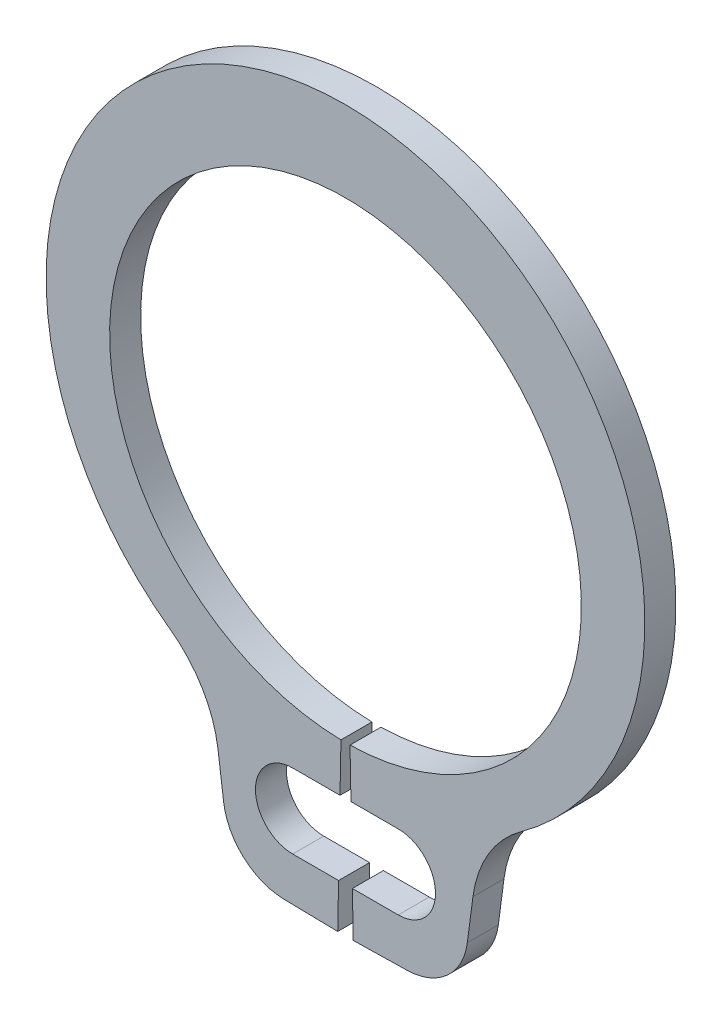
ISO-10303-21;
HEADER;
FILE_DESCRIPTION(('STEP AP214'),'2;1');
FILE_NAME('part.step','',(''),(''),'','','');
FILE_SCHEMA(('AUTOMOTIVE_DESIGN { 1 0 10303 214 1 1 1 1 }'));
ENDSEC;
DATA;
#1=APPLICATION_CONTEXT('core data for automotive mechanical design processes');
#2=APPLICATION_PROTOCOL_DEFINITION('international standard','automotive_design',2000,#1);
#3=PRODUCT_CONTEXT('',#1,'mechanical');
#4=PRODUCT('Part','Part','',(#3));
#5=PRODUCT_RELATED_PRODUCT_CATEGORY('part','',(#4));
#6=PRODUCT_DEFINITION_FORMATION('','',#4);
#7=PRODUCT_DEFINITION_CONTEXT('part definition',#1,'design');
#8=PRODUCT_DEFINITION('design','',#6,#7);
#9=PRODUCT_DEFINITION_SHAPE('','',#8);
#10=(LENGTH_UNIT() NAMED_UNIT(*) SI_UNIT(.MILLI.,.METRE.));
#11=(NAMED_UNIT(*) PLANE_ANGLE_UNIT() SI_UNIT($,.RADIAN.));
#12=(NAMED_UNIT(*) SI_UNIT($,.STERADIAN.) SOLID_ANGLE_UNIT());
#13=UNCERTAINTY_MEASURE_WITH_UNIT(LENGTH_MEASURE(1.E-05),#10,'distance_accuracy_value','');
#14=(GEOMETRIC_REPRESENTATION_CONTEXT(3) GLOBAL_UNCERTAINTY_ASSIGNED_CONTEXT((#13)) GLOBAL_UNIT_ASSIGNED_CONTEXT((#10,
#11,#12)) REPRESENTATION_CONTEXT('',''));
#15=CARTESIAN_POINT('',(0.,0.,0.));
#16=DIRECTION('',(0.,0.,1.));
#17=DIRECTION('',(1.,0.,0.));
#18=AXIS2_PLACEMENT_3D('',#15,#16,#17);
#19=CARTESIAN_POINT('',(-51.5537344991612,-0.604973268345121,26.0553388755765));
#20=DIRECTION('',(0.999815071658151,-0.0192307692307693,0.));
#21=DIRECTION('',(0.0192307692307693,0.999815071658151,0.));
#22=AXIS2_PLACEMENT_3D('',#19,#20,#21);
#23=PLANE('',#22);
#24=DIRECTION('',(0.,0.,1.));
#25=VECTOR('',#24,1.);
#26=CARTESIAN_POINT('',(-51.5612496991894,-0.99569140159236,26.0553388755765));
#27=LINE('',#26,#25);
#28=CARTESIAN_POINT('',(-51.5612496991894,-0.99569140159236,26.0553388755765));
#29=VERTEX_POINT('',#28);
#30=CARTESIAN_POINT('',(-51.5612496991894,-0.99569140159236,26.3053388755765));
#31=VERTEX_POINT('',#30);
#32=EDGE_CURVE('E222',#29,#31,#27,.T.);
#33=ORIENTED_EDGE('',*,*,#32,.F.);
#34=DIRECTION('',(0.0192307692307693,0.999815071658151,0.));
#35=VECTOR('',#34,1.);
#36=CARTESIAN_POINT('',(-51.5537344991612,-0.604973268345121,26.0553388755765));
#37=LINE('',#36,#35);
#38=CARTESIAN_POINT('',(-51.5537344991612,-0.604973268345121,26.0553388755765));
#39=VERTEX_POINT('',#38);
#40=EDGE_CURVE('E207',#29,#39,#37,.T.);
#41=ORIENTED_EDGE('',*,*,#40,.T.);
#42=DIRECTION('',(0.,0.,1.));
#43=VECTOR('',#42,1.);
#44=CARTESIAN_POINT('',(-51.5537344991612,-0.604973268345121,26.0553388755765));
#45=LINE('',#44,#43);
#46=CARTESIAN_POINT('',(-51.5537344991612,-0.604973268345121,26.3053388755765));
#47=VERTEX_POINT('',#46);
#48=EDGE_CURVE('E11',#39,#47,#45,.T.);
#49=ORIENTED_EDGE('',*,*,#48,.T.);
#50=DIRECTION('',(0.0192307692307693,0.999815071658151,0.));
#51=VECTOR('',#50,1.);
#52=CARTESIAN_POINT('',(-51.5537344991612,-0.604973268345121,26.3053388755765));
#53=LINE('',#52,#51);
#54=EDGE_CURVE('E324',#31,#47,#53,.T.);
#55=ORIENTED_EDGE('',*,*,#54,.F.);
#56=EDGE_LOOP('',(#33,#41,#49,#55));
#57=FACE_BOUND('',#56,.T.);
#58=ADVANCED_FACE('F45',(#57),#23,.T.);
#59=CARTESIAN_POINT('',(-51.4806575760843,-0.604973268345121,26.0553388755765));
#60=DIRECTION('',(-0.999815071658151,-0.019230769230769,0.));
#61=DIRECTION('',(0.019230769230769,-0.999815071658151,0.));
#62=AXIS2_PLACEMENT_3D('',#59,#60,#61);
#63=PLANE('',#62);
#64=DIRECTION('',(0.,0.,-1.));
#65=VECTOR('',#64,1.);
#66=CARTESIAN_POINT('',(-51.473142376056,-0.99569140159236,26.0553388755765));
#67=LINE('',#66,#65);
#68=CARTESIAN_POINT('',(-51.473142376056,-0.99569140159236,26.3053388755765));
#69=VERTEX_POINT('',#68);
#70=CARTESIAN_POINT('',(-51.473142376056,-0.99569140159236,26.0553388755765));
#71=VERTEX_POINT('',#70);
#72=EDGE_CURVE('E369',#69,#71,#67,.T.);
#73=ORIENTED_EDGE('',*,*,#72,.F.);
#74=DIRECTION('',(0.019230769230769,-0.999815071658151,0.));
#75=VECTOR('',#74,1.);
#76=CARTESIAN_POINT('',(-51.4806575760843,-0.604973268345121,26.3053388755765));
#77=LINE('',#76,#75);
#78=CARTESIAN_POINT('',(-51.4806575760843,-0.604973268345121,26.3053388755765));
#79=VERTEX_POINT('',#78);
#80=EDGE_CURVE('E284',#79,#69,#77,.T.);
#81=ORIENTED_EDGE('',*,*,#80,.F.);
#82=DIRECTION('',(0.,0.,1.));
#83=VECTOR('',#82,1.);
#84=CARTESIAN_POINT('',(-51.4806575760843,-0.604973268345121,26.0553388755765));
#85=LINE('',#84,#83);
#86=CARTESIAN_POINT('',(-51.4806575760843,-0.604973268345121,26.0553388755765));
#87=VERTEX_POINT('',#86);
#88=EDGE_CURVE('E49',#87,#79,#85,.T.);
#89=ORIENTED_EDGE('',*,*,#88,.F.);
#90=DIRECTION('',(0.019230769230769,-0.999815071658151,0.));
#91=VECTOR('',#90,1.);
#92=CARTESIAN_POINT('',(-51.4806575760843,-0.604973268345121,26.0553388755765));
#93=LINE('',#92,#91);
#94=EDGE_CURVE('E236',#87,#71,#93,.T.);
#95=ORIENTED_EDGE('',*,*,#94,.T.);
#96=EDGE_LOOP('',(#73,#81,#89,#95));
#97=FACE_BOUND('',#96,.T.);
#98=ADVANCED_FACE('F368',(#97),#63,.T.);
#99=CARTESIAN_POINT('',(-51.5171960376227,1.29467536780536,26.0553388755765));
#100=DIRECTION('',(0.,0.,1.));
#101=DIRECTION('',(1.,0.,0.));
#102=AXIS2_PLACEMENT_3D('',#99,#100,#101);
#103=CYLINDRICAL_SURFACE('',#102,1.9);
#104=CARTESIAN_POINT('',(-51.5171960376227,1.29467536780536,26.3053388755765));
#105=DIRECTION('',(0.,0.,-1.));
#106=DIRECTION('',(1.,0.,0.));
#107=AXIS2_PLACEMENT_3D('',#104,#105,#106);
#108=CIRCLE('',#107,1.9);
#109=EDGE_CURVE('E228',#47,#79,#108,.T.);
#110=ORIENTED_EDGE('',*,*,#109,.F.);
#111=ORIENTED_EDGE('',*,*,#48,.F.);
#112=CARTESIAN_POINT('',(-51.5171960376227,1.29467536780536,26.0553388755765));
#113=DIRECTION('',(0.,0.,-1.));
#114=DIRECTION('',(1.,0.,0.));
#115=AXIS2_PLACEMENT_3D('',#112,#113,#114);
#116=CIRCLE('',#115,1.9);
#117=EDGE_CURVE('E230',#39,#87,#116,.T.);
#118=ORIENTED_EDGE('',*,*,#117,.T.);
#119=ORIENTED_EDGE('',*,*,#88,.T.);
#120=EDGE_LOOP('',(#110,#111,#118,#119));
#121=FACE_BOUND('',#120,.T.);
#122=ADVANCED_FACE('F47',(#121),#103,.F.);
#123=DIRECTION('',(0.,0.,-1.));
#124=VECTOR('',#123,1.);
#125=CARTESIAN_POINT('',(-51.5727902949111,-1.59569140159236,26.0553388755765));
#126=LINE('',#125,#124);
#127=CARTESIAN_POINT('',(-51.5727902949111,-1.59569140159236,26.3053388755765));
#128=VERTEX_POINT('',#127);
#129=CARTESIAN_POINT('',(-51.5727902949111,-1.59569140159236,26.0553388755765));
#130=VERTEX_POINT('',#129);
#131=EDGE_CURVE('E400',#128,#130,#126,.T.);
#132=ORIENTED_EDGE('',*,*,#131,.F.);
#133=CARTESIAN_POINT('',(-51.5796960376227,-1.95472361508362,26.3053388755765));
#134=VERTEX_POINT('',#133);
#135=EDGE_CURVE('E235',#134,#128,#53,.T.);
#136=ORIENTED_EDGE('',*,*,#135,.F.);
#137=DIRECTION('',(0.,0.,1.));
#138=VECTOR('',#137,1.);
#139=CARTESIAN_POINT('',(-51.5796960376227,-1.95472361508362,26.0553388755765));
#140=LINE('',#139,#138);
#141=CARTESIAN_POINT('',(-51.5796960376227,-1.95472361508362,26.0553388755765));
#142=VERTEX_POINT('',#141);
#143=EDGE_CURVE('E55',#142,#134,#140,.T.);
#144=ORIENTED_EDGE('',*,*,#143,.F.);
#145=EDGE_CURVE('E276',#142,#130,#37,.T.);
#146=ORIENTED_EDGE('',*,*,#145,.T.);
#147=EDGE_LOOP('',(#132,#136,#144,#146));
#148=FACE_BOUND('',#147,.T.);
#149=ADVANCED_FACE('F429',(#148),#23,.T.);
#150=CARTESIAN_POINT('',(-51.5796960376227,-1.95472361508362,26.0553388755765));
#151=DIRECTION('',(-0.0192307692307683,-0.999815071658151,0.));
#152=DIRECTION('',(0.999815071658151,-0.0192307692307683,0.));
#153=AXIS2_PLACEMENT_3D('',#150,#151,#152);
#154=PLANE('',#153);
#155=DIRECTION('',(0.999815071658151,-0.0192307692307683,0.));
#156=VECTOR('',#155,1.);
#157=CARTESIAN_POINT('',(-51.5796960376227,-1.95472361508362,26.3053388755765));
#158=LINE('',#157,#156);
#159=CARTESIAN_POINT('',(-52.0124323239493,-1.94640022419262,26.3053388755765));
#160=VERTEX_POINT('',#159);
#161=EDGE_CURVE('E320',#160,#134,#158,.T.);
#162=ORIENTED_EDGE('',*,*,#161,.F.);
#163=DIRECTION('',(0.,0.,1.));
#164=VECTOR('',#163,1.);
#165=CARTESIAN_POINT('',(-52.0124323239493,-1.94640022419262,26.0553388755765));
#166=LINE('',#165,#164);
#167=CARTESIAN_POINT('',(-52.0124323239493,-1.94640022419262,26.0553388755765));
#168=VERTEX_POINT('',#167);
#169=EDGE_CURVE('E330',#168,#160,#166,.T.);
#170=ORIENTED_EDGE('',*,*,#169,.F.);
#171=DIRECTION('',(0.999815071658151,-0.0192307692307683,0.));
#172=VECTOR('',#171,1.);
#173=CARTESIAN_POINT('',(-51.5796960376227,-1.95472361508362,26.0553388755765));
#174=LINE('',#173,#172);
#175=EDGE_CURVE('E272',#168,#142,#174,.T.);
#176=ORIENTED_EDGE('',*,*,#175,.T.);
#177=ORIENTED_EDGE('',*,*,#143,.T.);
#178=EDGE_LOOP('',(#162,#170,#176,#177));
#179=FACE_BOUND('',#178,.T.);
#180=ADVANCED_FACE('F435',(#179),#154,.T.);
#181=CARTESIAN_POINT('',(-52.0028169393339,-1.44649268836355,26.0553388755765));
#182=DIRECTION('',(0.,0.,1.));
#183=DIRECTION('',(1.,0.,0.));
#184=AXIS2_PLACEMENT_3D('',#181,#182,#183);
#185=CYLINDRICAL_SURFACE('',#184,0.5);
#186=CARTESIAN_POINT('',(-52.0028169393339,-1.44649268836355,26.3053388755765));
#187=DIRECTION('',(0.,0.,1.));
#188=DIRECTION('',(1.,0.,0.));
#189=AXIS2_PLACEMENT_3D('',#186,#187,#188);
#190=CIRCLE('',#189,0.5);
#191=CARTESIAN_POINT('',(-52.4985393700208,-1.51175578447357,26.3053388755765));
#192=VERTEX_POINT('',#191);
#193=EDGE_CURVE('E316',#192,#160,#190,.T.);
#194=ORIENTED_EDGE('',*,*,#193,.F.);
#195=DIRECTION('',(0.,0.,1.));
#196=VECTOR('',#195,1.);
#197=CARTESIAN_POINT('',(-52.4985393700208,-1.51175578447357,26.0553388755765));
#198=LINE('',#197,#196);
#199=CARTESIAN_POINT('',(-52.4985393700208,-1.51175578447357,26.0553388755765));
#200=VERTEX_POINT('',#199);
#201=EDGE_CURVE('E333',#200,#192,#198,.T.);
#202=ORIENTED_EDGE('',*,*,#201,.F.);
#203=CARTESIAN_POINT('',(-52.0028169393339,-1.44649268836355,26.0553388755765));
#204=DIRECTION('',(0.,0.,1.));
#205=DIRECTION('',(1.,0.,0.));
#206=AXIS2_PLACEMENT_3D('',#203,#204,#205);
#207=CIRCLE('',#206,0.5);
#208=EDGE_CURVE('E268',#200,#168,#207,.T.);
#209=ORIENTED_EDGE('',*,*,#208,.T.);
#210=ORIENTED_EDGE('',*,*,#169,.T.);
#211=EDGE_LOOP('',(#194,#202,#209,#210));
#212=FACE_BOUND('',#211,.T.);
#213=ADVANCED_FACE('F441',(#212),#185,.T.);
#214=CARTESIAN_POINT('',(-52.5438349039949,-1.16770204600146,26.0553388755765));
#215=DIRECTION('',(-0.99144486137381,-0.130526192220052,0.));
#216=DIRECTION('',(0.130526192220052,-0.99144486137381,0.));
#217=AXIS2_PLACEMENT_3D('',#214,#215,#216);
#218=PLANE('',#217);
#219=DIRECTION('',(0.130526192220052,-0.99144486137381,0.));
#220=VECTOR('',#219,1.);
#221=CARTESIAN_POINT('',(-52.5438349039949,-1.16770204600146,26.3053388755765));
#222=LINE('',#221,#220);
#223=CARTESIAN_POINT('',(-52.5438349039949,-1.16770204600146,26.3053388755765));
#224=VERTEX_POINT('',#223);
#225=EDGE_CURVE('E312',#224,#192,#222,.T.);
#226=ORIENTED_EDGE('',*,*,#225,.F.);
#227=DIRECTION('',(0.,0.,1.));
#228=VECTOR('',#227,1.);
#229=CARTESIAN_POINT('',(-52.5438349039949,-1.16770204600146,26.0553388755765));
#230=LINE('',#229,#228);
#231=CARTESIAN_POINT('',(-52.5438349039949,-1.16770204600146,26.0553388755765));
#232=VERTEX_POINT('',#231);
#233=EDGE_CURVE('E336',#232,#224,#230,.T.);
#234=ORIENTED_EDGE('',*,*,#233,.F.);
#235=DIRECTION('',(0.130526192220052,-0.99144486137381,0.));
#236=VECTOR('',#235,1.);
#237=CARTESIAN_POINT('',(-52.5438349039949,-1.16770204600146,26.0553388755765));
#238=LINE('',#237,#236);
#239=EDGE_CURVE('E264',#232,#200,#238,.T.);
#240=ORIENTED_EDGE('',*,*,#239,.T.);
#241=ORIENTED_EDGE('',*,*,#201,.T.);
#242=EDGE_LOOP('',(#226,#234,#240,#241));
#243=FACE_BOUND('',#242,.T.);
#244=ADVANCED_FACE('F580',(#243),#218,.T.);
#245=CARTESIAN_POINT('',(-53.4852993061026,-1.29164818592856,26.0553388755765));
#246=DIRECTION('',(0.,0.,1.));
#247=DIRECTION('',(1.,0.,0.));
#248=AXIS2_PLACEMENT_3D('',#245,#246,#247);
#249=CYLINDRICAL_SURFACE('',#248,0.949588261321083);
#250=CARTESIAN_POINT('',(-53.4852993061026,-1.29164818592856,26.3053388755765));
#251=DIRECTION('',(0.,0.,-1.));
#252=DIRECTION('',(1.,0.,0.));
#253=AXIS2_PLACEMENT_3D('',#250,#251,#252);
#254=CIRCLE('',#253,0.949588261321083);
#255=CARTESIAN_POINT('',(-52.9292788355123,-0.521869579884333,26.3053388755765));
#256=VERTEX_POINT('',#255);
#257=EDGE_CURVE('E308',#256,#224,#254,.T.);
#258=ORIENTED_EDGE('',*,*,#257,.F.);
#259=DIRECTION('',(0.,0.,1.));
#260=VECTOR('',#259,1.);
#261=CARTESIAN_POINT('',(-52.9292788355123,-0.521869579884333,26.0553388755765));
#262=LINE('',#261,#260);
#263=CARTESIAN_POINT('',(-52.9292788355123,-0.521869579884333,26.0553388755765));
#264=VERTEX_POINT('',#263);
#265=EDGE_CURVE('E339',#264,#256,#262,.T.);
#266=ORIENTED_EDGE('',*,*,#265,.F.);
#267=CARTESIAN_POINT('',(-53.4852993061026,-1.29164818592856,26.0553388755765));
#268=DIRECTION('',(0.,0.,-1.));
#269=DIRECTION('',(1.,0.,0.));
#270=AXIS2_PLACEMENT_3D('',#267,#268,#269);
#271=CIRCLE('',#270,0.949588261321083);
#272=EDGE_CURVE('E260',#264,#232,#271,.T.);
#273=ORIENTED_EDGE('',*,*,#272,.T.);
#274=ORIENTED_EDGE('',*,*,#233,.T.);
#275=EDGE_LOOP('',(#258,#266,#273,#274));
#276=FACE_BOUND('',#275,.T.);
#277=ADVANCED_FACE('F570',(#276),#249,.F.);
#278=CARTESIAN_POINT('',(-51.5171960376227,1.43307845759456,26.0553388755765));
#279=DIRECTION('',(0.,0.,1.));
#280=DIRECTION('',(1.,0.,0.));
#281=AXIS2_PLACEMENT_3D('',#278,#279,#280);
#282=CYLINDRICAL_SURFACE('',#281,2.41159691021081);
#283=CARTESIAN_POINT('',(-51.5171960376227,1.43307845759456,26.3053388755765));
#284=DIRECTION('',(0.,0.,1.));
#285=DIRECTION('',(1.,0.,0.));
#286=AXIS2_PLACEMENT_3D('',#283,#284,#285);
#287=CIRCLE('',#286,2.41159691021081);
#288=CARTESIAN_POINT('',(-50.1051132397331,-0.521869579884334,26.3053388755765));
#289=VERTEX_POINT('',#288);
#290=EDGE_CURVE('E304',#289,#256,#287,.T.);
#291=ORIENTED_EDGE('',*,*,#290,.F.);
#292=DIRECTION('',(0.,0.,1.));
#293=VECTOR('',#292,1.);
#294=CARTESIAN_POINT('',(-50.1051132397331,-0.521869579884334,26.0553388755765));
#295=LINE('',#294,#293);
#296=CARTESIAN_POINT('',(-50.1051132397331,-0.521869579884334,26.0553388755765));
#297=VERTEX_POINT('',#296);
#298=EDGE_CURVE('E342',#297,#289,#295,.T.);
#299=ORIENTED_EDGE('',*,*,#298,.F.);
#300=CARTESIAN_POINT('',(-51.5171960376227,1.43307845759456,26.0553388755765));
#301=DIRECTION('',(0.,0.,1.));
#302=DIRECTION('',(1.,0.,0.));
#303=AXIS2_PLACEMENT_3D('',#300,#301,#302);
#304=CIRCLE('',#303,2.41159691021081);
#305=EDGE_CURVE('E256',#297,#264,#304,.T.);
#306=ORIENTED_EDGE('',*,*,#305,.T.);
#307=ORIENTED_EDGE('',*,*,#265,.T.);
#308=EDGE_LOOP('',(#291,#299,#306,#307));
#309=FACE_BOUND('',#308,.T.);
#310=ADVANCED_FACE('F560',(#309),#282,.T.);
#311=CARTESIAN_POINT('',(-49.5490927691429,-1.29164818592856,26.0553388755765));
#312=DIRECTION('',(0.,0.,1.));
#313=DIRECTION('',(1.,0.,0.));
#314=AXIS2_PLACEMENT_3D('',#311,#312,#313);
#315=CYLINDRICAL_SURFACE('',#314,0.949588261321083);
#316=CARTESIAN_POINT('',(-49.5490927691429,-1.29164818592856,26.3053388755765));
#317=DIRECTION('',(0.,0.,-1.));
#318=DIRECTION('',(1.,0.,0.));
#319=AXIS2_PLACEMENT_3D('',#316,#317,#318);
#320=CIRCLE('',#319,0.949588261321083);
#321=CARTESIAN_POINT('',(-50.4905571712505,-1.16770204600146,26.3053388755765));
#322=VERTEX_POINT('',#321);
#323=EDGE_CURVE('E300',#322,#289,#320,.T.);
#324=ORIENTED_EDGE('',*,*,#323,.F.);
#325=DIRECTION('',(0.,0.,1.));
#326=VECTOR('',#325,1.);
#327=CARTESIAN_POINT('',(-50.4905571712505,-1.16770204600146,26.0553388755765));
#328=LINE('',#327,#326);
#329=CARTESIAN_POINT('',(-50.4905571712505,-1.16770204600146,26.0553388755765));
#330=VERTEX_POINT('',#329);
#331=EDGE_CURVE('E345',#330,#322,#328,.T.);
#332=ORIENTED_EDGE('',*,*,#331,.F.);
#333=CARTESIAN_POINT('',(-49.5490927691429,-1.29164818592856,26.0553388755765));
#334=DIRECTION('',(0.,0.,-1.));
#335=DIRECTION('',(1.,0.,0.));
#336=AXIS2_PLACEMENT_3D('',#333,#334,#335);
#337=CIRCLE('',#336,0.949588261321083);
#338=EDGE_CURVE('E252',#330,#297,#337,.T.);
#339=ORIENTED_EDGE('',*,*,#338,.T.);
#340=ORIENTED_EDGE('',*,*,#298,.T.);
#341=EDGE_LOOP('',(#324,#332,#339,#340));
#342=FACE_BOUND('',#341,.T.);
#343=ADVANCED_FACE('F550',(#342),#315,.F.);
#344=CARTESIAN_POINT('',(-50.4905571712505,-1.16770204600146,26.0553388755765));
#345=DIRECTION('',(0.99144486137381,-0.130526192220054,0.));
#346=DIRECTION('',(0.130526192220054,0.99144486137381,0.));
#347=AXIS2_PLACEMENT_3D('',#344,#345,#346);
#348=PLANE('',#347);
#349=DIRECTION('',(0.130526192220054,0.99144486137381,0.));
#350=VECTOR('',#349,1.);
#351=CARTESIAN_POINT('',(-50.4905571712505,-1.16770204600146,26.3053388755765));
#352=LINE('',#351,#350);
#353=CARTESIAN_POINT('',(-50.5358527052247,-1.51175578447357,26.3053388755765));
#354=VERTEX_POINT('',#353);
#355=EDGE_CURVE('E296',#354,#322,#352,.T.);
#356=ORIENTED_EDGE('',*,*,#355,.F.);
#357=DIRECTION('',(0.,0.,1.));
#358=VECTOR('',#357,1.);
#359=CARTESIAN_POINT('',(-50.5358527052247,-1.51175578447357,26.0553388755765));
#360=LINE('',#359,#358);
#361=CARTESIAN_POINT('',(-50.5358527052247,-1.51175578447357,26.0553388755765));
#362=VERTEX_POINT('',#361);
#363=EDGE_CURVE('E348',#362,#354,#360,.T.);
#364=ORIENTED_EDGE('',*,*,#363,.F.);
#365=DIRECTION('',(0.130526192220054,0.99144486137381,0.));
#366=VECTOR('',#365,1.);
#367=CARTESIAN_POINT('',(-50.4905571712505,-1.16770204600146,26.0553388755765));
#368=LINE('',#367,#366);
#369=EDGE_CURVE('E248',#362,#330,#368,.T.);
#370=ORIENTED_EDGE('',*,*,#369,.T.);
#371=ORIENTED_EDGE('',*,*,#331,.T.);
#372=EDGE_LOOP('',(#356,#364,#370,#371));
#373=FACE_BOUND('',#372,.T.);
#374=ADVANCED_FACE('F540',(#373),#348,.T.);
#375=CARTESIAN_POINT('',(-51.0315751359116,-1.44649268836355,26.0553388755765));
#376=DIRECTION('',(0.,0.,1.));
#377=DIRECTION('',(1.,0.,0.));
#378=AXIS2_PLACEMENT_3D('',#375,#376,#377);
#379=CYLINDRICAL_SURFACE('',#378,0.5);
#380=CARTESIAN_POINT('',(-51.0315751359116,-1.44649268836355,26.3053388755765));
#381=DIRECTION('',(0.,0.,1.));
#382=DIRECTION('',(-1.,0.,0.));
#383=AXIS2_PLACEMENT_3D('',#380,#381,#382);
#384=CIRCLE('',#383,0.5);
#385=CARTESIAN_POINT('',(-51.0219597512962,-1.94640022419262,26.3053388755765));
#386=VERTEX_POINT('',#385);
#387=EDGE_CURVE('E292',#386,#354,#384,.T.);
#388=ORIENTED_EDGE('',*,*,#387,.F.);
#389=DIRECTION('',(0.,0.,1.));
#390=VECTOR('',#389,1.);
#391=CARTESIAN_POINT('',(-51.0219597512962,-1.94640022419262,26.0553388755765));
#392=LINE('',#391,#390);
#393=CARTESIAN_POINT('',(-51.0219597512962,-1.94640022419262,26.0553388755765));
#394=VERTEX_POINT('',#393);
#395=EDGE_CURVE('E351',#394,#386,#392,.T.);
#396=ORIENTED_EDGE('',*,*,#395,.F.);
#397=CARTESIAN_POINT('',(-51.0315751359116,-1.44649268836355,26.0553388755765));
#398=DIRECTION('',(0.,0.,1.));
#399=DIRECTION('',(-1.,0.,0.));
#400=AXIS2_PLACEMENT_3D('',#397,#398,#399);
#401=CIRCLE('',#400,0.5);
#402=EDGE_CURVE('E244',#394,#362,#401,.T.);
#403=ORIENTED_EDGE('',*,*,#402,.T.);
#404=ORIENTED_EDGE('',*,*,#363,.T.);
#405=EDGE_LOOP('',(#388,#396,#403,#404));
#406=FACE_BOUND('',#405,.T.);
#407=ADVANCED_FACE('F423',(#406),#379,.T.);
#408=CARTESIAN_POINT('',(-51.4546960376227,-1.95472361508362,26.0553388755765));
#409=DIRECTION('',(0.0192307692307683,-0.999815071658151,0.));
#410=DIRECTION('',(0.999815071658151,0.0192307692307683,0.));
#411=AXIS2_PLACEMENT_3D('',#408,#409,#410);
#412=PLANE('',#411);
#413=DIRECTION('',(0.999815071658151,0.0192307692307683,0.));
#414=VECTOR('',#413,1.);
#415=CARTESIAN_POINT('',(-51.4546960376227,-1.95472361508362,26.3053388755765));
#416=LINE('',#415,#414);
#417=CARTESIAN_POINT('',(-51.4546960376227,-1.95472361508362,26.3053388755765));
#418=VERTEX_POINT('',#417);
#419=EDGE_CURVE('E288',#418,#386,#416,.T.);
#420=ORIENTED_EDGE('',*,*,#419,.F.);
#421=DIRECTION('',(0.,0.,1.));
#422=VECTOR('',#421,1.);
#423=CARTESIAN_POINT('',(-51.4546960376227,-1.95472361508362,26.0553388755765));
#424=LINE('',#423,#422);
#425=CARTESIAN_POINT('',(-51.4546960376227,-1.95472361508362,26.0553388755765));
#426=VERTEX_POINT('',#425);
#427=EDGE_CURVE('E353',#426,#418,#424,.T.);
#428=ORIENTED_EDGE('',*,*,#427,.F.);
#429=DIRECTION('',(0.999815071658151,0.0192307692307683,0.));
#430=VECTOR('',#429,1.);
#431=CARTESIAN_POINT('',(-51.4546960376227,-1.95472361508362,26.0553388755765));
#432=LINE('',#431,#430);
#433=EDGE_CURVE('E240',#426,#394,#432,.T.);
#434=ORIENTED_EDGE('',*,*,#433,.T.);
#435=ORIENTED_EDGE('',*,*,#395,.T.);
#436=EDGE_LOOP('',(#420,#428,#434,#435));
#437=FACE_BOUND('',#436,.T.);
#438=ADVANCED_FACE('F417',(#437),#412,.T.);
#439=DIRECTION('',(0.,0.,1.));
#440=VECTOR('',#439,1.);
#441=CARTESIAN_POINT('',(-51.4616017803343,-1.59569140159236,26.0553388755765));
#442=LINE('',#441,#440);
#443=CARTESIAN_POINT('',(-51.4616017803343,-1.59569140159236,26.0553388755765));
#444=VERTEX_POINT('',#443);
#445=CARTESIAN_POINT('',(-51.4616017803343,-1.59569140159236,26.3053388755765));
#446=VERTEX_POINT('',#445);
#447=EDGE_CURVE('E392',#444,#446,#442,.T.);
#448=ORIENTED_EDGE('',*,*,#447,.F.);
#449=EDGE_CURVE('E234',#444,#426,#93,.T.);
#450=ORIENTED_EDGE('',*,*,#449,.T.);
#451=ORIENTED_EDGE('',*,*,#427,.T.);
#452=EDGE_CURVE('E283',#446,#418,#77,.T.);
#453=ORIENTED_EDGE('',*,*,#452,.F.);
#454=EDGE_LOOP('',(#448,#450,#451,#453));
#455=FACE_BOUND('',#454,.T.);
#456=ADVANCED_FACE('F415',(#455),#63,.T.);
#457=CARTESIAN_POINT('',(-51.5171960376227,1.29467536780536,26.0553388755765));
#458=DIRECTION('',(0.,0.,1.));
#459=DIRECTION('',(1.,0.,0.));
#460=AXIS2_PLACEMENT_3D('',#457,#458,#459);
#461=PLANE('',#460);
#462=CARTESIAN_POINT('',(-51.0921960376227,-1.29569140159236,26.0553388755765));
#463=DIRECTION('',(0.,0.,1.));
#464=DIRECTION('',(1.,0.,0.));
#465=AXIS2_PLACEMENT_3D('',#462,#463,#464);
#466=CIRCLE('',#465,0.3);
#467=CARTESIAN_POINT('',(-51.0921960376227,-1.59569140159236,26.0553388755765));
#468=VERTEX_POINT('',#467);
#469=CARTESIAN_POINT('',(-51.0921960376227,-0.99569140159236,26.0553388755765));
#470=VERTEX_POINT('',#469);
#471=EDGE_CURVE('E220',#468,#470,#466,.T.);
#472=ORIENTED_EDGE('',*,*,#471,.T.);
#473=DIRECTION('',(-1.,0.,0.));
#474=VECTOR('',#473,1.);
#475=CARTESIAN_POINT('',(-51.9421960376227,-0.99569140159236,26.0553388755765));
#476=LINE('',#475,#474);
#477=EDGE_CURVE('E71',#470,#71,#476,.T.);
#478=ORIENTED_EDGE('',*,*,#477,.T.);
#479=ORIENTED_EDGE('',*,*,#94,.F.);
#480=ORIENTED_EDGE('',*,*,#117,.F.);
#481=ORIENTED_EDGE('',*,*,#40,.F.);
#482=CARTESIAN_POINT('',(-51.9421960376227,-0.99569140159236,26.0553388755765));
#483=VERTEX_POINT('',#482);
#484=EDGE_CURVE('E187',#29,#483,#476,.T.);
#485=ORIENTED_EDGE('',*,*,#484,.T.);
#486=CARTESIAN_POINT('',(-51.9421960376227,-1.29569140159236,26.0553388755765));
#487=DIRECTION('',(0.,0.,1.));
#488=DIRECTION('',(1.,0.,0.));
#489=AXIS2_PLACEMENT_3D('',#486,#487,#488);
#490=CIRCLE('',#489,0.3);
#491=CARTESIAN_POINT('',(-51.9421960376227,-1.59569140159236,26.0553388755765));
#492=VERTEX_POINT('',#491);
#493=EDGE_CURVE('E205',#483,#492,#490,.T.);
#494=ORIENTED_EDGE('',*,*,#493,.T.);
#495=DIRECTION('',(1.,0.,0.));
#496=VECTOR('',#495,1.);
#497=CARTESIAN_POINT('',(-51.0921960376227,-1.59569140159236,26.0553388755765));
#498=LINE('',#497,#496);
#499=EDGE_CURVE('E197',#492,#130,#498,.T.);
#500=ORIENTED_EDGE('',*,*,#499,.T.);
#501=ORIENTED_EDGE('',*,*,#145,.F.);
#502=ORIENTED_EDGE('',*,*,#175,.F.);
#503=ORIENTED_EDGE('',*,*,#208,.F.);
#504=ORIENTED_EDGE('',*,*,#239,.F.);
#505=ORIENTED_EDGE('',*,*,#272,.F.);
#506=ORIENTED_EDGE('',*,*,#305,.F.);
#507=ORIENTED_EDGE('',*,*,#338,.F.);
#508=ORIENTED_EDGE('',*,*,#369,.F.);
#509=ORIENTED_EDGE('',*,*,#402,.F.);
#510=ORIENTED_EDGE('',*,*,#433,.F.);
#511=ORIENTED_EDGE('',*,*,#449,.F.);
#512=EDGE_CURVE('E379',#444,#468,#498,.T.);
#513=ORIENTED_EDGE('',*,*,#512,.T.);
#514=EDGE_LOOP('',(#472,#478,#479,#480,#481,#485,#494,#500,#501,#502,#503,#504,#505,#506,#507,
#508,#509,#510,#511,#513));
#515=FACE_BOUND('',#514,.T.);
#516=ADVANCED_FACE('F203',(#515),#461,.F.);
#517=CARTESIAN_POINT('',(-51.5171960376227,1.29467536780536,26.3053388755765));
#518=DIRECTION('',(0.,0.,1.));
#519=DIRECTION('',(1.,0.,0.));
#520=AXIS2_PLACEMENT_3D('',#517,#518,#519);
#521=PLANE('',#520);
#522=DIRECTION('',(-1.,0.,0.));
#523=VECTOR('',#522,1.);
#524=CARTESIAN_POINT('',(-51.9421960376227,-0.99569140159236,26.3053388755765));
#525=LINE('',#524,#523);
#526=CARTESIAN_POINT('',(-51.0921960376227,-0.99569140159236,26.3053388755765));
#527=VERTEX_POINT('',#526);
#528=EDGE_CURVE('E384',#527,#69,#525,.T.);
#529=ORIENTED_EDGE('',*,*,#528,.F.);
#530=CARTESIAN_POINT('',(-51.0921960376227,-1.29569140159236,26.3053388755765));
#531=DIRECTION('',(0.,0.,1.));
#532=DIRECTION('',(1.,0.,0.));
#533=AXIS2_PLACEMENT_3D('',#530,#531,#532);
#534=CIRCLE('',#533,0.3);
#535=CARTESIAN_POINT('',(-51.0921960376227,-1.59569140159236,26.3053388755765));
#536=VERTEX_POINT('',#535);
#537=EDGE_CURVE('E214',#536,#527,#534,.T.);
#538=ORIENTED_EDGE('',*,*,#537,.F.);
#539=DIRECTION('',(1.,0.,0.));
#540=VECTOR('',#539,1.);
#541=CARTESIAN_POINT('',(-51.0921960376227,-1.59569140159236,26.3053388755765));
#542=LINE('',#541,#540);
#543=EDGE_CURVE('E63',#446,#536,#542,.T.);
#544=ORIENTED_EDGE('',*,*,#543,.F.);
#545=ORIENTED_EDGE('',*,*,#452,.T.);
#546=ORIENTED_EDGE('',*,*,#419,.T.);
#547=ORIENTED_EDGE('',*,*,#387,.T.);
#548=ORIENTED_EDGE('',*,*,#355,.T.);
#549=ORIENTED_EDGE('',*,*,#323,.T.);
#550=ORIENTED_EDGE('',*,*,#290,.T.);
#551=ORIENTED_EDGE('',*,*,#257,.T.);
#552=ORIENTED_EDGE('',*,*,#225,.T.);
#553=ORIENTED_EDGE('',*,*,#193,.T.);
#554=ORIENTED_EDGE('',*,*,#161,.T.);
#555=ORIENTED_EDGE('',*,*,#135,.T.);
#556=CARTESIAN_POINT('',(-51.9421960376227,-1.59569140159236,26.3053388755765));
#557=VERTEX_POINT('',#556);
#558=EDGE_CURVE('E209',#557,#128,#542,.T.);
#559=ORIENTED_EDGE('',*,*,#558,.F.);
#560=CARTESIAN_POINT('',(-51.9421960376227,-1.29569140159236,26.3053388755765));
#561=DIRECTION('',(0.,0.,1.));
#562=DIRECTION('',(1.,0.,0.));
#563=AXIS2_PLACEMENT_3D('',#560,#561,#562);
#564=CIRCLE('',#563,0.3);
#565=CARTESIAN_POINT('',(-51.9421960376227,-0.99569140159236,26.3053388755765));
#566=VERTEX_POINT('',#565);
#567=EDGE_CURVE('E215',#566,#557,#564,.T.);
#568=ORIENTED_EDGE('',*,*,#567,.F.);
#569=EDGE_CURVE('E190',#31,#566,#525,.T.);
#570=ORIENTED_EDGE('',*,*,#569,.F.);
#571=ORIENTED_EDGE('',*,*,#54,.T.);
#572=ORIENTED_EDGE('',*,*,#109,.T.);
#573=ORIENTED_EDGE('',*,*,#80,.T.);
#574=EDGE_LOOP('',(#529,#538,#544,#545,#546,#547,#548,#549,#550,#551,#552,#553,#554,#555,#559,
#568,#570,#571,#572,#573));
#575=FACE_BOUND('',#574,.T.);
#576=ADVANCED_FACE('F372',(#575),#521,.T.);
#577=CARTESIAN_POINT('',(-51.0921960376227,-1.29569140159236,26.0553388755765));
#578=DIRECTION('',(0.,0.,1.));
#579=DIRECTION('',(1.,0.,0.));
#580=AXIS2_PLACEMENT_3D('',#577,#578,#579);
#581=CYLINDRICAL_SURFACE('',#580,0.3);
#582=ORIENTED_EDGE('',*,*,#537,.T.);
#583=DIRECTION('',(0.,0.,1.));
#584=VECTOR('',#583,1.);
#585=CARTESIAN_POINT('',(-51.0921960376227,-0.99569140159236,26.0553388755765));
#586=LINE('',#585,#584);
#587=EDGE_CURVE('E389',#470,#527,#586,.T.);
#588=ORIENTED_EDGE('',*,*,#587,.F.);
#589=ORIENTED_EDGE('',*,*,#471,.F.);
#590=DIRECTION('',(0.,0.,1.));
#591=VECTOR('',#590,1.);
#592=CARTESIAN_POINT('',(-51.0921960376227,-1.59569140159236,26.0553388755765));
#593=LINE('',#592,#591);
#594=EDGE_CURVE('E393',#468,#536,#593,.T.);
#595=ORIENTED_EDGE('',*,*,#594,.T.);
#596=EDGE_LOOP('',(#582,#588,#589,#595));
#597=FACE_BOUND('',#596,.T.);
#598=ADVANCED_FACE('F407',(#597),#581,.F.);
#599=CARTESIAN_POINT('',(-51.9421960376227,-1.29569140159236,26.0553388755765));
#600=DIRECTION('',(0.,0.,1.));
#601=DIRECTION('',(1.,0.,0.));
#602=AXIS2_PLACEMENT_3D('',#599,#600,#601);
#603=CYLINDRICAL_SURFACE('',#602,0.3);
#604=ORIENTED_EDGE('',*,*,#567,.T.);
#605=DIRECTION('',(0.,0.,1.));
#606=VECTOR('',#605,1.);
#607=CARTESIAN_POINT('',(-51.9421960376227,-1.59569140159236,26.0553388755765));
#608=LINE('',#607,#606);
#609=EDGE_CURVE('E196',#492,#557,#608,.T.);
#610=ORIENTED_EDGE('',*,*,#609,.F.);
#611=ORIENTED_EDGE('',*,*,#493,.F.);
#612=DIRECTION('',(0.,0.,1.));
#613=VECTOR('',#612,1.);
#614=CARTESIAN_POINT('',(-51.9421960376227,-0.99569140159236,26.0553388755765));
#615=LINE('',#614,#613);
#616=EDGE_CURVE('E184',#483,#566,#615,.T.);
#617=ORIENTED_EDGE('',*,*,#616,.T.);
#618=EDGE_LOOP('',(#604,#610,#611,#617));
#619=FACE_BOUND('',#618,.T.);
#620=ADVANCED_FACE('F212',(#619),#603,.F.);
#621=CARTESIAN_POINT('',(-51.9421960376227,-0.99569140159236,26.0553388755765));
#622=DIRECTION('',(0.,1.,0.));
#623=DIRECTION('',(0.,0.,1.));
#624=AXIS2_PLACEMENT_3D('',#621,#622,#623);
#625=PLANE('',#624);
#626=ORIENTED_EDGE('',*,*,#32,.T.);
#627=ORIENTED_EDGE('',*,*,#569,.T.);
#628=ORIENTED_EDGE('',*,*,#616,.F.);
#629=ORIENTED_EDGE('',*,*,#484,.F.);
#630=EDGE_LOOP('',(#626,#627,#628,#629));
#631=FACE_BOUND('',#630,.T.);
#632=ADVANCED_FACE('F186',(#631),#625,.F.);
#633=CARTESIAN_POINT('',(-51.0921960376227,-1.59569140159236,26.0553388755765));
#634=DIRECTION('',(0.,-1.,0.));
#635=DIRECTION('',(0.,0.,-1.));
#636=AXIS2_PLACEMENT_3D('',#633,#634,#635);
#637=PLANE('',#636);
#638=ORIENTED_EDGE('',*,*,#131,.T.);
#639=ORIENTED_EDGE('',*,*,#499,.F.);
#640=ORIENTED_EDGE('',*,*,#609,.T.);
#641=ORIENTED_EDGE('',*,*,#558,.T.);
#642=EDGE_LOOP('',(#638,#639,#640,#641));
#643=FACE_BOUND('',#642,.T.);
#644=ADVANCED_FACE('F452',(#643),#637,.F.);
#645=ORIENTED_EDGE('',*,*,#447,.T.);
#646=ORIENTED_EDGE('',*,*,#543,.T.);
#647=ORIENTED_EDGE('',*,*,#594,.F.);
#648=ORIENTED_EDGE('',*,*,#512,.F.);
#649=EDGE_LOOP('',(#645,#646,#647,#648));
#650=FACE_BOUND('',#649,.T.);
#651=ADVANCED_FACE('F408',(#650),#637,.F.);
#652=ORIENTED_EDGE('',*,*,#72,.T.);
#653=ORIENTED_EDGE('',*,*,#477,.F.);
#654=ORIENTED_EDGE('',*,*,#587,.T.);
#655=ORIENTED_EDGE('',*,*,#528,.T.);
#656=EDGE_LOOP('',(#652,#653,#654,#655));
#657=FACE_BOUND('',#656,.T.);
#658=ADVANCED_FACE('F404',(#657),#625,.F.);
#659=CLOSED_SHELL('',(#58,#98,#122,#149,#180,#213,#244,#277,#310,#343,#374,#407,#438,#456,#516,
#576,#598,#620,#632,#644,#651,#658));
#660=MANIFOLD_SOLID_BREP('B2',#659);
#661=ADVANCED_BREP_SHAPE_REPRESENTATION('',(#18,#660),#14);
#662=SHAPE_DEFINITION_REPRESENTATION(#9,#661);
ENDSEC;
END-ISO-10303-21;
